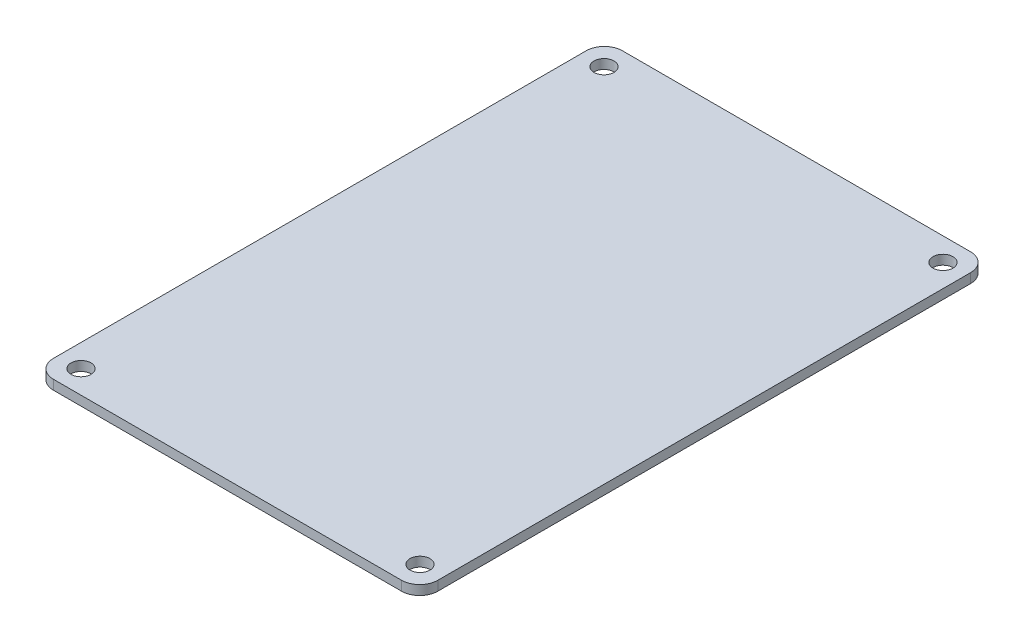
ISO-10303-21;
HEADER;
FILE_DESCRIPTION(('STEP AP214'),'2;1');
FILE_NAME('part.step','',(''),(''),'','','');
FILE_SCHEMA(('AUTOMOTIVE_DESIGN { 1 0 10303 214 1 1 1 1 }'));
ENDSEC;
DATA;
#1=APPLICATION_CONTEXT('core data for automotive mechanical design processes');
#2=APPLICATION_PROTOCOL_DEFINITION('international standard','automotive_design',2000,#1);
#3=PRODUCT_CONTEXT('',#1,'mechanical');
#4=PRODUCT('Part','Part','',(#3));
#5=PRODUCT_RELATED_PRODUCT_CATEGORY('part','',(#4));
#6=PRODUCT_DEFINITION_FORMATION('','',#4);
#7=PRODUCT_DEFINITION_CONTEXT('part definition',#1,'design');
#8=PRODUCT_DEFINITION('design','',#6,#7);
#9=PRODUCT_DEFINITION_SHAPE('','',#8);
#10=(LENGTH_UNIT() NAMED_UNIT(*) SI_UNIT(.MILLI.,.METRE.));
#11=(NAMED_UNIT(*) PLANE_ANGLE_UNIT() SI_UNIT($,.RADIAN.));
#12=(NAMED_UNIT(*) SI_UNIT($,.STERADIAN.) SOLID_ANGLE_UNIT());
#13=UNCERTAINTY_MEASURE_WITH_UNIT(LENGTH_MEASURE(1.E-05),#10,'distance_accuracy_value','');
#14=(GEOMETRIC_REPRESENTATION_CONTEXT(3) GLOBAL_UNCERTAINTY_ASSIGNED_CONTEXT((#13)) GLOBAL_UNIT_ASSIGNED_CONTEXT((#10,
#11,#12)) REPRESENTATION_CONTEXT('',''));
#15=CARTESIAN_POINT('',(0.,0.,0.));
#16=DIRECTION('',(0.,0.,1.));
#17=DIRECTION('',(1.,0.,0.));
#18=AXIS2_PLACEMENT_3D('',#15,#16,#17);
#19=CARTESIAN_POINT('',(0.,1.57,0.));
#20=DIRECTION('',(0.,1.,0.));
#21=DIRECTION('',(0.,0.,1.));
#22=AXIS2_PLACEMENT_3D('',#19,#20,#21);
#23=PLANE('',#22);
#24=CARTESIAN_POINT('',(28.,1.57,43.2));
#25=DIRECTION('',(0.,1.,0.));
#26=DIRECTION('',(0.,0.,1.));
#27=AXIS2_PLACEMENT_3D('',#24,#25,#26);
#28=CIRCLE('',#27,1.65);
#29=CARTESIAN_POINT('',(28.,1.57,44.85));
#30=VERTEX_POINT('',#29);
#31=EDGE_CURVE('E189',#30,#30,#28,.T.);
#32=ORIENTED_EDGE('',*,*,#31,.F.);
#33=EDGE_LOOP('',(#32));
#34=FACE_BOUND('',#33,.T.);
#35=CARTESIAN_POINT('',(-28.,1.57,-43.2));
#36=DIRECTION('',(0.,1.,0.));
#37=DIRECTION('',(0.,0.,1.));
#38=AXIS2_PLACEMENT_3D('',#35,#36,#37);
#39=CIRCLE('',#38,1.65);
#40=CARTESIAN_POINT('',(-28.,1.57,-41.55));
#41=VERTEX_POINT('',#40);
#42=EDGE_CURVE('E179',#41,#41,#39,.T.);
#43=ORIENTED_EDGE('',*,*,#42,.F.);
#44=EDGE_LOOP('',(#43));
#45=FACE_BOUND('',#44,.T.);
#46=DIRECTION('',(-1.,0.,0.));
#47=VECTOR('',#46,1.);
#48=CARTESIAN_POINT('',(-31.75,1.57,-47.));
#49=LINE('',#48,#47);
#50=CARTESIAN_POINT('',(28.75,1.57,-47.));
#51=VERTEX_POINT('',#50);
#52=CARTESIAN_POINT('',(-28.75,1.57,-47.));
#53=VERTEX_POINT('',#52);
#54=EDGE_CURVE('E170',#51,#53,#49,.T.);
#55=ORIENTED_EDGE('',*,*,#54,.T.);
#56=CARTESIAN_POINT('',(-28.75,1.57,-44.));
#57=DIRECTION('',(0.,1.,0.));
#58=DIRECTION('',(0.,0.,1.));
#59=AXIS2_PLACEMENT_3D('',#56,#57,#58);
#60=CIRCLE('',#59,3.);
#61=CARTESIAN_POINT('',(-31.75,1.57,-44.));
#62=VERTEX_POINT('',#61);
#63=EDGE_CURVE('E148',#53,#62,#60,.T.);
#64=ORIENTED_EDGE('',*,*,#63,.T.);
#65=DIRECTION('',(0.,0.,1.));
#66=VECTOR('',#65,1.);
#67=CARTESIAN_POINT('',(-31.75,1.57,-47.));
#68=LINE('',#67,#66);
#69=CARTESIAN_POINT('',(-31.75,1.57,44.));
#70=VERTEX_POINT('',#69);
#71=EDGE_CURVE('E118',#62,#70,#68,.T.);
#72=ORIENTED_EDGE('',*,*,#71,.T.);
#73=CARTESIAN_POINT('',(-28.75,1.57,44.));
#74=DIRECTION('',(0.,1.,0.));
#75=DIRECTION('',(0.,0.,1.));
#76=AXIS2_PLACEMENT_3D('',#73,#74,#75);
#77=CIRCLE('',#76,3.);
#78=CARTESIAN_POINT('',(-28.75,1.57,47.));
#79=VERTEX_POINT('',#78);
#80=EDGE_CURVE('E54',#70,#79,#77,.T.);
#81=ORIENTED_EDGE('',*,*,#80,.T.);
#82=DIRECTION('',(1.,0.,0.));
#83=VECTOR('',#82,1.);
#84=CARTESIAN_POINT('',(-31.75,1.57,47.));
#85=LINE('',#84,#83);
#86=CARTESIAN_POINT('',(28.75,1.57,47.));
#87=VERTEX_POINT('',#86);
#88=EDGE_CURVE('E134',#79,#87,#85,.T.);
#89=ORIENTED_EDGE('',*,*,#88,.T.);
#90=CARTESIAN_POINT('',(28.75,1.57,44.));
#91=DIRECTION('',(0.,1.,0.));
#92=DIRECTION('',(0.,0.,1.));
#93=AXIS2_PLACEMENT_3D('',#90,#91,#92);
#94=CIRCLE('',#93,3.);
#95=CARTESIAN_POINT('',(31.75,1.57,44.));
#96=VERTEX_POINT('',#95);
#97=EDGE_CURVE('E144',#87,#96,#94,.T.);
#98=ORIENTED_EDGE('',*,*,#97,.T.);
#99=DIRECTION('',(0.,0.,-1.));
#100=VECTOR('',#99,1.);
#101=CARTESIAN_POINT('',(31.75,1.57,-47.));
#102=LINE('',#101,#100);
#103=CARTESIAN_POINT('',(31.75,1.57,-44.));
#104=VERTEX_POINT('',#103);
#105=EDGE_CURVE('E128',#96,#104,#102,.T.);
#106=ORIENTED_EDGE('',*,*,#105,.T.);
#107=CARTESIAN_POINT('',(28.75,1.57,-44.));
#108=DIRECTION('',(0.,1.,0.));
#109=DIRECTION('',(0.,0.,1.));
#110=AXIS2_PLACEMENT_3D('',#107,#108,#109);
#111=CIRCLE('',#110,3.);
#112=EDGE_CURVE('E146',#104,#51,#111,.T.);
#113=ORIENTED_EDGE('',*,*,#112,.T.);
#114=EDGE_LOOP('',(#55,#64,#72,#81,#89,#98,#106,#113));
#115=FACE_BOUND('',#114,.T.);
#116=CARTESIAN_POINT('',(28.,1.57,-43.2));
#117=DIRECTION('',(0.,1.,0.));
#118=DIRECTION('',(0.,0.,-1.));
#119=AXIS2_PLACEMENT_3D('',#116,#117,#118);
#120=CIRCLE('',#119,1.65);
#121=CARTESIAN_POINT('',(28.,1.57,-44.85));
#122=VERTEX_POINT('',#121);
#123=EDGE_CURVE('E184',#122,#122,#120,.T.);
#124=ORIENTED_EDGE('',*,*,#123,.F.);
#125=EDGE_LOOP('',(#124));
#126=FACE_BOUND('',#125,.T.);
#127=CARTESIAN_POINT('',(-28.,1.57,43.2));
#128=DIRECTION('',(0.,1.,0.));
#129=DIRECTION('',(0.,0.,-1.));
#130=AXIS2_PLACEMENT_3D('',#127,#128,#129);
#131=CIRCLE('',#130,1.65);
#132=CARTESIAN_POINT('',(-28.,1.57,41.55));
#133=VERTEX_POINT('',#132);
#134=EDGE_CURVE('E195',#133,#133,#131,.T.);
#135=ORIENTED_EDGE('',*,*,#134,.F.);
#136=EDGE_LOOP('',(#135));
#137=FACE_BOUND('',#136,.T.);
#138=ADVANCED_FACE('F34',(#34,#45,#115,#126,#137),#23,.T.);
#139=CARTESIAN_POINT('',(0.,0.,0.));
#140=DIRECTION('',(0.,1.,0.));
#141=DIRECTION('',(0.,0.,1.));
#142=AXIS2_PLACEMENT_3D('',#139,#140,#141);
#143=PLANE('',#142);
#144=DIRECTION('',(0.,0.,1.));
#145=VECTOR('',#144,1.);
#146=CARTESIAN_POINT('',(-31.75,0.,-47.));
#147=LINE('',#146,#145);
#148=CARTESIAN_POINT('',(-31.75,0.,-44.));
#149=VERTEX_POINT('',#148);
#150=CARTESIAN_POINT('',(-31.75,0.,44.));
#151=VERTEX_POINT('',#150);
#152=EDGE_CURVE('E116',#149,#151,#147,.T.);
#153=ORIENTED_EDGE('',*,*,#152,.F.);
#154=CARTESIAN_POINT('',(-28.75,0.,-44.));
#155=DIRECTION('',(0.,1.,0.));
#156=DIRECTION('',(0.,0.,1.));
#157=AXIS2_PLACEMENT_3D('',#154,#155,#156);
#158=CIRCLE('',#157,3.);
#159=CARTESIAN_POINT('',(-28.75,0.,-47.));
#160=VERTEX_POINT('',#159);
#161=EDGE_CURVE('E99',#149,#160,#158,.F.);
#162=ORIENTED_EDGE('',*,*,#161,.T.);
#163=DIRECTION('',(-1.,0.,0.));
#164=VECTOR('',#163,1.);
#165=CARTESIAN_POINT('',(-31.75,0.,-47.));
#166=LINE('',#165,#164);
#167=CARTESIAN_POINT('',(28.75,0.,-47.));
#168=VERTEX_POINT('',#167);
#169=EDGE_CURVE('E126',#168,#160,#166,.T.);
#170=ORIENTED_EDGE('',*,*,#169,.F.);
#171=CARTESIAN_POINT('',(28.75,0.,-44.));
#172=DIRECTION('',(0.,1.,0.));
#173=DIRECTION('',(0.,0.,1.));
#174=AXIS2_PLACEMENT_3D('',#171,#172,#173);
#175=CIRCLE('',#174,3.);
#176=CARTESIAN_POINT('',(31.75,0.,-44.));
#177=VERTEX_POINT('',#176);
#178=EDGE_CURVE('E110',#168,#177,#175,.F.);
#179=ORIENTED_EDGE('',*,*,#178,.T.);
#180=DIRECTION('',(0.,0.,-1.));
#181=VECTOR('',#180,1.);
#182=CARTESIAN_POINT('',(31.75,0.,-47.));
#183=LINE('',#182,#181);
#184=CARTESIAN_POINT('',(31.75,0.,44.));
#185=VERTEX_POINT('',#184);
#186=EDGE_CURVE('E130',#185,#177,#183,.T.);
#187=ORIENTED_EDGE('',*,*,#186,.F.);
#188=CARTESIAN_POINT('',(28.75,0.,44.));
#189=DIRECTION('',(0.,1.,0.));
#190=DIRECTION('',(0.,0.,1.));
#191=AXIS2_PLACEMENT_3D('',#188,#189,#190);
#192=CIRCLE('',#191,3.);
#193=CARTESIAN_POINT('',(28.75,0.,47.));
#194=VERTEX_POINT('',#193);
#195=EDGE_CURVE('E137',#185,#194,#192,.F.);
#196=ORIENTED_EDGE('',*,*,#195,.T.);
#197=DIRECTION('',(1.,0.,0.));
#198=VECTOR('',#197,1.);
#199=CARTESIAN_POINT('',(-31.75,0.,47.));
#200=LINE('',#199,#198);
#201=CARTESIAN_POINT('',(-28.75,0.,47.));
#202=VERTEX_POINT('',#201);
#203=EDGE_CURVE('E125',#202,#194,#200,.T.);
#204=ORIENTED_EDGE('',*,*,#203,.F.);
#205=CARTESIAN_POINT('',(-28.75,0.,44.));
#206=DIRECTION('',(0.,1.,0.));
#207=DIRECTION('',(0.,0.,1.));
#208=AXIS2_PLACEMENT_3D('',#205,#206,#207);
#209=CIRCLE('',#208,3.);
#210=EDGE_CURVE('E119',#202,#151,#209,.F.);
#211=ORIENTED_EDGE('',*,*,#210,.T.);
#212=EDGE_LOOP('',(#153,#162,#170,#179,#187,#196,#204,#211));
#213=FACE_BOUND('',#212,.T.);
#214=CARTESIAN_POINT('',(-28.,0.,-43.2));
#215=DIRECTION('',(0.,1.,0.));
#216=DIRECTION('',(0.,0.,1.));
#217=AXIS2_PLACEMENT_3D('',#214,#215,#216);
#218=CIRCLE('',#217,1.65);
#219=CARTESIAN_POINT('',(-28.,0.,-41.55));
#220=VERTEX_POINT('',#219);
#221=EDGE_CURVE('E175',#220,#220,#218,.T.);
#222=ORIENTED_EDGE('',*,*,#221,.T.);
#223=EDGE_LOOP('',(#222));
#224=FACE_BOUND('',#223,.T.);
#225=CARTESIAN_POINT('',(28.,0.,-43.2));
#226=DIRECTION('',(0.,1.,0.));
#227=DIRECTION('',(0.,0.,-1.));
#228=AXIS2_PLACEMENT_3D('',#225,#226,#227);
#229=CIRCLE('',#228,1.65);
#230=CARTESIAN_POINT('',(28.,0.,-44.85));
#231=VERTEX_POINT('',#230);
#232=EDGE_CURVE('E186',#231,#231,#229,.T.);
#233=ORIENTED_EDGE('',*,*,#232,.T.);
#234=EDGE_LOOP('',(#233));
#235=FACE_BOUND('',#234,.T.);
#236=CARTESIAN_POINT('',(28.,0.,43.2));
#237=DIRECTION('',(0.,1.,0.));
#238=DIRECTION('',(0.,0.,1.));
#239=AXIS2_PLACEMENT_3D('',#236,#237,#238);
#240=CIRCLE('',#239,1.65);
#241=CARTESIAN_POINT('',(28.,0.,44.85));
#242=VERTEX_POINT('',#241);
#243=EDGE_CURVE('E192',#242,#242,#240,.T.);
#244=ORIENTED_EDGE('',*,*,#243,.T.);
#245=EDGE_LOOP('',(#244));
#246=FACE_BOUND('',#245,.T.);
#247=CARTESIAN_POINT('',(-28.,0.,43.2));
#248=DIRECTION('',(0.,1.,0.));
#249=DIRECTION('',(0.,0.,-1.));
#250=AXIS2_PLACEMENT_3D('',#247,#248,#249);
#251=CIRCLE('',#250,1.65);
#252=CARTESIAN_POINT('',(-28.,0.,41.55));
#253=VERTEX_POINT('',#252);
#254=EDGE_CURVE('E198',#253,#253,#251,.T.);
#255=ORIENTED_EDGE('',*,*,#254,.T.);
#256=EDGE_LOOP('',(#255));
#257=FACE_BOUND('',#256,.T.);
#258=ADVANCED_FACE('F122',(#213,#224,#235,#246,#257),#143,.F.);
#259=CARTESIAN_POINT('',(31.75,1.57,-47.));
#260=DIRECTION('',(-1.,0.,0.));
#261=DIRECTION('',(0.,0.,1.));
#262=AXIS2_PLACEMENT_3D('',#259,#260,#261);
#263=PLANE('',#262);
#264=ORIENTED_EDGE('',*,*,#186,.T.);
#265=DIRECTION('',(0.,-1.,0.));
#266=VECTOR('',#265,1.);
#267=CARTESIAN_POINT('',(31.75,1.57,-44.));
#268=LINE('',#267,#266);
#269=EDGE_CURVE('E153',#177,#104,#268,.F.);
#270=ORIENTED_EDGE('',*,*,#269,.T.);
#271=ORIENTED_EDGE('',*,*,#105,.F.);
#272=DIRECTION('',(0.,-1.,0.));
#273=VECTOR('',#272,1.);
#274=CARTESIAN_POINT('',(31.75,1.57,44.));
#275=LINE('',#274,#273);
#276=EDGE_CURVE('E150',#96,#185,#275,.T.);
#277=ORIENTED_EDGE('',*,*,#276,.T.);
#278=EDGE_LOOP('',(#264,#270,#271,#277));
#279=FACE_BOUND('',#278,.T.);
#280=ADVANCED_FACE('F166',(#279),#263,.F.);
#281=CARTESIAN_POINT('',(-31.75,1.57,-47.));
#282=DIRECTION('',(0.,0.,1.));
#283=DIRECTION('',(1.,0.,0.));
#284=AXIS2_PLACEMENT_3D('',#281,#282,#283);
#285=PLANE('',#284);
#286=ORIENTED_EDGE('',*,*,#169,.T.);
#287=DIRECTION('',(0.,-1.,0.));
#288=VECTOR('',#287,1.);
#289=CARTESIAN_POINT('',(-28.75,1.57,-47.));
#290=LINE('',#289,#288);
#291=EDGE_CURVE('E104',#160,#53,#290,.F.);
#292=ORIENTED_EDGE('',*,*,#291,.T.);
#293=ORIENTED_EDGE('',*,*,#54,.F.);
#294=DIRECTION('',(0.,-1.,0.));
#295=VECTOR('',#294,1.);
#296=CARTESIAN_POINT('',(28.75,1.57,-47.));
#297=LINE('',#296,#295);
#298=EDGE_CURVE('E109',#51,#168,#297,.T.);
#299=ORIENTED_EDGE('',*,*,#298,.T.);
#300=EDGE_LOOP('',(#286,#292,#293,#299));
#301=FACE_BOUND('',#300,.T.);
#302=ADVANCED_FACE('F224',(#301),#285,.F.);
#303=CARTESIAN_POINT('',(-31.75,1.57,-47.));
#304=DIRECTION('',(1.,0.,0.));
#305=DIRECTION('',(0.,0.,-1.));
#306=AXIS2_PLACEMENT_3D('',#303,#304,#305);
#307=PLANE('',#306);
#308=ORIENTED_EDGE('',*,*,#71,.F.);
#309=DIRECTION('',(0.,-1.,0.));
#310=VECTOR('',#309,1.);
#311=CARTESIAN_POINT('',(-31.75,1.57,-44.));
#312=LINE('',#311,#310);
#313=EDGE_CURVE('E103',#62,#149,#312,.T.);
#314=ORIENTED_EDGE('',*,*,#313,.T.);
#315=ORIENTED_EDGE('',*,*,#152,.T.);
#316=DIRECTION('',(0.,-1.,0.));
#317=VECTOR('',#316,1.);
#318=CARTESIAN_POINT('',(-31.75,1.57,44.));
#319=LINE('',#318,#317);
#320=EDGE_CURVE('E120',#151,#70,#319,.F.);
#321=ORIENTED_EDGE('',*,*,#320,.T.);
#322=EDGE_LOOP('',(#308,#314,#315,#321));
#323=FACE_BOUND('',#322,.T.);
#324=ADVANCED_FACE('F115',(#323),#307,.F.);
#325=CARTESIAN_POINT('',(-31.75,1.57,47.));
#326=DIRECTION('',(0.,0.,-1.));
#327=DIRECTION('',(-1.,0.,0.));
#328=AXIS2_PLACEMENT_3D('',#325,#326,#327);
#329=PLANE('',#328);
#330=ORIENTED_EDGE('',*,*,#203,.T.);
#331=DIRECTION('',(0.,-1.,0.));
#332=VECTOR('',#331,1.);
#333=CARTESIAN_POINT('',(28.75,1.57,47.));
#334=LINE('',#333,#332);
#335=EDGE_CURVE('E11',#194,#87,#334,.F.);
#336=ORIENTED_EDGE('',*,*,#335,.T.);
#337=ORIENTED_EDGE('',*,*,#88,.F.);
#338=DIRECTION('',(0.,-1.,0.));
#339=VECTOR('',#338,1.);
#340=CARTESIAN_POINT('',(-28.75,1.57,47.));
#341=LINE('',#340,#339);
#342=EDGE_CURVE('E42',#79,#202,#341,.T.);
#343=ORIENTED_EDGE('',*,*,#342,.T.);
#344=EDGE_LOOP('',(#330,#336,#337,#343));
#345=FACE_BOUND('',#344,.T.);
#346=ADVANCED_FACE('F156',(#345),#329,.F.);
#347=CARTESIAN_POINT('',(-28.,1.57,-43.2));
#348=DIRECTION('',(0.,-1.,0.));
#349=DIRECTION('',(0.,0.,-1.));
#350=AXIS2_PLACEMENT_3D('',#347,#348,#349);
#351=CYLINDRICAL_SURFACE('',#350,1.65);
#352=ORIENTED_EDGE('',*,*,#42,.T.);
#353=EDGE_LOOP('',(#352));
#354=FACE_BOUND('',#353,.T.);
#355=ORIENTED_EDGE('',*,*,#221,.F.);
#356=EDGE_LOOP('',(#355));
#357=FACE_BOUND('',#356,.T.);
#358=ADVANCED_FACE('F217',(#354,#357),#351,.F.);
#359=CARTESIAN_POINT('',(28.,1.57,-43.2));
#360=DIRECTION('',(0.,-1.,0.));
#361=DIRECTION('',(0.,0.,-1.));
#362=AXIS2_PLACEMENT_3D('',#359,#360,#361);
#363=CYLINDRICAL_SURFACE('',#362,1.65);
#364=ORIENTED_EDGE('',*,*,#123,.T.);
#365=EDGE_LOOP('',(#364));
#366=FACE_BOUND('',#365,.T.);
#367=ORIENTED_EDGE('',*,*,#232,.F.);
#368=EDGE_LOOP('',(#367));
#369=FACE_BOUND('',#368,.T.);
#370=ADVANCED_FACE('F246',(#366,#369),#363,.F.);
#371=CARTESIAN_POINT('',(28.,1.57,43.2));
#372=DIRECTION('',(0.,-1.,0.));
#373=DIRECTION('',(0.,0.,-1.));
#374=AXIS2_PLACEMENT_3D('',#371,#372,#373);
#375=CYLINDRICAL_SURFACE('',#374,1.65);
#376=ORIENTED_EDGE('',*,*,#31,.T.);
#377=EDGE_LOOP('',(#376));
#378=FACE_BOUND('',#377,.T.);
#379=ORIENTED_EDGE('',*,*,#243,.F.);
#380=EDGE_LOOP('',(#379));
#381=FACE_BOUND('',#380,.T.);
#382=ADVANCED_FACE('F249',(#378,#381),#375,.F.);
#383=CARTESIAN_POINT('',(-28.,1.57,43.2));
#384=DIRECTION('',(0.,-1.,0.));
#385=DIRECTION('',(0.,0.,-1.));
#386=AXIS2_PLACEMENT_3D('',#383,#384,#385);
#387=CYLINDRICAL_SURFACE('',#386,1.65);
#388=ORIENTED_EDGE('',*,*,#134,.T.);
#389=EDGE_LOOP('',(#388));
#390=FACE_BOUND('',#389,.T.);
#391=ORIENTED_EDGE('',*,*,#254,.F.);
#392=EDGE_LOOP('',(#391));
#393=FACE_BOUND('',#392,.T.);
#394=ADVANCED_FACE('F204',(#390,#393),#387,.F.);
#395=CARTESIAN_POINT('',(-28.75,1.57,-44.));
#396=DIRECTION('',(0.,-1.,0.));
#397=DIRECTION('',(0.,0.,-1.));
#398=AXIS2_PLACEMENT_3D('',#395,#396,#397);
#399=CYLINDRICAL_SURFACE('',#398,3.);
#400=ORIENTED_EDGE('',*,*,#63,.F.);
#401=ORIENTED_EDGE('',*,*,#291,.F.);
#402=ORIENTED_EDGE('',*,*,#161,.F.);
#403=ORIENTED_EDGE('',*,*,#313,.F.);
#404=EDGE_LOOP('',(#400,#401,#402,#403));
#405=FACE_BOUND('',#404,.T.);
#406=ADVANCED_FACE('F102',(#405),#399,.T.);
#407=CARTESIAN_POINT('',(28.75,1.57,-44.));
#408=DIRECTION('',(0.,-1.,0.));
#409=DIRECTION('',(0.,0.,-1.));
#410=AXIS2_PLACEMENT_3D('',#407,#408,#409);
#411=CYLINDRICAL_SURFACE('',#410,3.);
#412=ORIENTED_EDGE('',*,*,#112,.F.);
#413=ORIENTED_EDGE('',*,*,#269,.F.);
#414=ORIENTED_EDGE('',*,*,#178,.F.);
#415=ORIENTED_EDGE('',*,*,#298,.F.);
#416=EDGE_LOOP('',(#412,#413,#414,#415));
#417=FACE_BOUND('',#416,.T.);
#418=ADVANCED_FACE('F232',(#417),#411,.T.);
#419=CARTESIAN_POINT('',(28.75,1.57,44.));
#420=DIRECTION('',(0.,-1.,0.));
#421=DIRECTION('',(0.,0.,-1.));
#422=AXIS2_PLACEMENT_3D('',#419,#420,#421);
#423=CYLINDRICAL_SURFACE('',#422,3.);
#424=ORIENTED_EDGE('',*,*,#97,.F.);
#425=ORIENTED_EDGE('',*,*,#335,.F.);
#426=ORIENTED_EDGE('',*,*,#195,.F.);
#427=ORIENTED_EDGE('',*,*,#276,.F.);
#428=EDGE_LOOP('',(#424,#425,#426,#427));
#429=FACE_BOUND('',#428,.T.);
#430=ADVANCED_FACE('F163',(#429),#423,.T.);
#431=CARTESIAN_POINT('',(-28.75,1.57,44.));
#432=DIRECTION('',(0.,-1.,0.));
#433=DIRECTION('',(0.,0.,-1.));
#434=AXIS2_PLACEMENT_3D('',#431,#432,#433);
#435=CYLINDRICAL_SURFACE('',#434,3.);
#436=ORIENTED_EDGE('',*,*,#80,.F.);
#437=ORIENTED_EDGE('',*,*,#320,.F.);
#438=ORIENTED_EDGE('',*,*,#210,.F.);
#439=ORIENTED_EDGE('',*,*,#342,.F.);
#440=EDGE_LOOP('',(#436,#437,#438,#439));
#441=FACE_BOUND('',#440,.T.);
#442=ADVANCED_FACE('F36',(#441),#435,.T.);
#443=CLOSED_SHELL('',(#138,#258,#280,#302,#324,#346,#358,#370,#382,#394,#406,#418,#430,#442));
#444=MANIFOLD_SOLID_BREP('B2',#443);
#445=ADVANCED_BREP_SHAPE_REPRESENTATION('',(#18,#444),#14);
#446=SHAPE_DEFINITION_REPRESENTATION(#9,#445);
ENDSEC;
END-ISO-10303-21;
